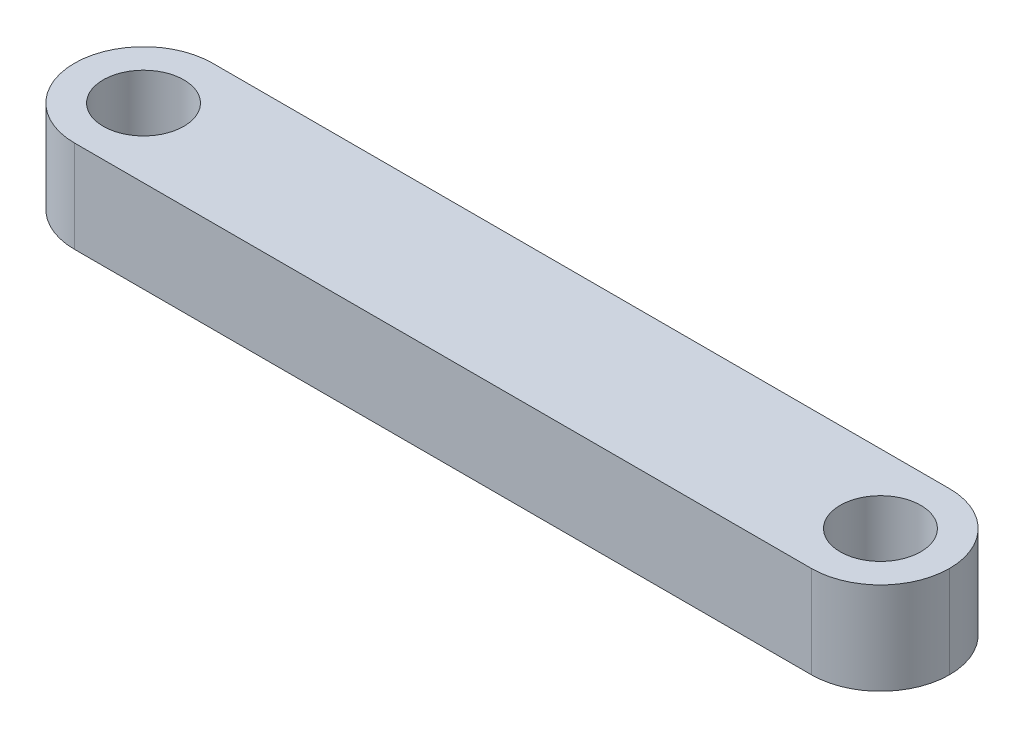
ISO-10303-21;
HEADER;
FILE_DESCRIPTION(('STEP AP214'),'2;1');
FILE_NAME('part.step','',(''),(''),'','','');
FILE_SCHEMA(('AUTOMOTIVE_DESIGN { 1 0 10303 214 1 1 1 1 }'));
ENDSEC;
DATA;
#1=APPLICATION_CONTEXT('core data for automotive mechanical design processes');
#2=APPLICATION_PROTOCOL_DEFINITION('international standard','automotive_design',2000,#1);
#3=PRODUCT_CONTEXT('',#1,'mechanical');
#4=PRODUCT('Part','Part','',(#3));
#5=PRODUCT_RELATED_PRODUCT_CATEGORY('part','',(#4));
#6=PRODUCT_DEFINITION_FORMATION('','',#4);
#7=PRODUCT_DEFINITION_CONTEXT('part definition',#1,'design');
#8=PRODUCT_DEFINITION('design','',#6,#7);
#9=PRODUCT_DEFINITION_SHAPE('','',#8);
#10=(LENGTH_UNIT() NAMED_UNIT(*) SI_UNIT(.MILLI.,.METRE.));
#11=(NAMED_UNIT(*) PLANE_ANGLE_UNIT() SI_UNIT($,.RADIAN.));
#12=(NAMED_UNIT(*) SI_UNIT($,.STERADIAN.) SOLID_ANGLE_UNIT());
#13=UNCERTAINTY_MEASURE_WITH_UNIT(LENGTH_MEASURE(1.E-05),#10,'distance_accuracy_value','');
#14=(GEOMETRIC_REPRESENTATION_CONTEXT(3) GLOBAL_UNCERTAINTY_ASSIGNED_CONTEXT((#13)) GLOBAL_UNIT_ASSIGNED_CONTEXT((#10,
#11,#12)) REPRESENTATION_CONTEXT('',''));
#15=CARTESIAN_POINT('',(0.,0.,0.));
#16=DIRECTION('',(0.,0.,1.));
#17=DIRECTION('',(1.,0.,0.));
#18=AXIS2_PLACEMENT_3D('',#15,#16,#17);
#19=CARTESIAN_POINT('',(0.,4.,0.));
#20=DIRECTION('',(0.,-1.,0.));
#21=DIRECTION('',(0.,0.,-1.));
#22=AXIS2_PLACEMENT_3D('',#19,#20,#21);
#23=PLANE('',#22);
#24=CARTESIAN_POINT('',(35.,4.,-3.));
#25=DIRECTION('',(0.,-1.,0.));
#26=DIRECTION('',(0.,0.,-1.));
#27=AXIS2_PLACEMENT_3D('',#24,#25,#26);
#28=CIRCLE('',#27,3.);
#29=CARTESIAN_POINT('',(35.,4.,0.));
#30=VERTEX_POINT('',#29);
#31=CARTESIAN_POINT('',(38.,4.,-3.));
#32=VERTEX_POINT('',#31);
#33=EDGE_CURVE('E54',#30,#32,#28,.F.);
#34=ORIENTED_EDGE('',*,*,#33,.T.);
#35=CARTESIAN_POINT('',(35.,4.,-3.));
#36=DIRECTION('',(0.,-1.,0.));
#37=DIRECTION('',(0.,0.,-1.));
#38=AXIS2_PLACEMENT_3D('',#35,#36,#37);
#39=CIRCLE('',#38,3.);
#40=CARTESIAN_POINT('',(35.,4.,-6.));
#41=VERTEX_POINT('',#40);
#42=EDGE_CURVE('E136',#32,#41,#39,.F.);
#43=ORIENTED_EDGE('',*,*,#42,.T.);
#44=DIRECTION('',(-1.,0.,0.));
#45=VECTOR('',#44,1.);
#46=CARTESIAN_POINT('',(0.,4.,-6.));
#47=LINE('',#46,#45);
#48=CARTESIAN_POINT('',(3.,4.,-6.));
#49=VERTEX_POINT('',#48);
#50=EDGE_CURVE('E112',#41,#49,#47,.T.);
#51=ORIENTED_EDGE('',*,*,#50,.T.);
#52=CARTESIAN_POINT('',(3.,4.,-3.));
#53=DIRECTION('',(0.,-1.,0.));
#54=DIRECTION('',(0.,0.,-1.));
#55=AXIS2_PLACEMENT_3D('',#52,#53,#54);
#56=CIRCLE('',#55,3.);
#57=CARTESIAN_POINT('',(0.,4.,-3.));
#58=VERTEX_POINT('',#57);
#59=EDGE_CURVE('E133',#49,#58,#56,.F.);
#60=ORIENTED_EDGE('',*,*,#59,.T.);
#61=CARTESIAN_POINT('',(3.,4.,-3.));
#62=DIRECTION('',(0.,-1.,0.));
#63=DIRECTION('',(0.,0.,-1.));
#64=AXIS2_PLACEMENT_3D('',#61,#62,#63);
#65=CIRCLE('',#64,3.);
#66=CARTESIAN_POINT('',(3.,4.,0.));
#67=VERTEX_POINT('',#66);
#68=EDGE_CURVE('E101',#58,#67,#65,.F.);
#69=ORIENTED_EDGE('',*,*,#68,.T.);
#70=DIRECTION('',(1.,0.,0.));
#71=VECTOR('',#70,1.);
#72=CARTESIAN_POINT('',(0.,4.,0.));
#73=LINE('',#72,#71);
#74=EDGE_CURVE('E120',#67,#30,#73,.T.);
#75=ORIENTED_EDGE('',*,*,#74,.T.);
#76=EDGE_LOOP('',(#34,#43,#51,#60,#69,#75));
#77=FACE_BOUND('',#76,.T.);
#78=CARTESIAN_POINT('',(3.,4.,-3.));
#79=DIRECTION('',(0.,1.,0.));
#80=DIRECTION('',(0.,0.,1.));
#81=AXIS2_PLACEMENT_3D('',#78,#79,#80);
#82=CIRCLE('',#81,1.75);
#83=CARTESIAN_POINT('',(3.,4.,-1.25));
#84=VERTEX_POINT('',#83);
#85=EDGE_CURVE('E124',#84,#84,#82,.T.);
#86=ORIENTED_EDGE('',*,*,#85,.F.);
#87=EDGE_LOOP('',(#86));
#88=FACE_BOUND('',#87,.T.);
#89=CARTESIAN_POINT('',(35.,4.,-3.));
#90=DIRECTION('',(0.,1.,0.));
#91=DIRECTION('',(0.,0.,1.));
#92=AXIS2_PLACEMENT_3D('',#89,#90,#91);
#93=CIRCLE('',#92,1.75);
#94=CARTESIAN_POINT('',(35.,4.,-1.25));
#95=VERTEX_POINT('',#94);
#96=EDGE_CURVE('E140',#95,#95,#93,.T.);
#97=ORIENTED_EDGE('',*,*,#96,.F.);
#98=EDGE_LOOP('',(#97));
#99=FACE_BOUND('',#98,.T.);
#100=ADVANCED_FACE('F37',(#77,#88,#99),#23,.F.);
#101=CARTESIAN_POINT('',(0.,0.,0.));
#102=DIRECTION('',(0.,-1.,0.));
#103=DIRECTION('',(0.,0.,-1.));
#104=AXIS2_PLACEMENT_3D('',#101,#102,#103);
#105=PLANE('',#104);
#106=CARTESIAN_POINT('',(3.,0.,-3.));
#107=DIRECTION('',(0.,1.,0.));
#108=DIRECTION('',(0.,0.,1.));
#109=AXIS2_PLACEMENT_3D('',#106,#107,#108);
#110=CIRCLE('',#109,1.75);
#111=CARTESIAN_POINT('',(3.,0.,-1.25));
#112=VERTEX_POINT('',#111);
#113=EDGE_CURVE('E156',#112,#112,#110,.T.);
#114=ORIENTED_EDGE('',*,*,#113,.T.);
#115=EDGE_LOOP('',(#114));
#116=FACE_BOUND('',#115,.T.);
#117=DIRECTION('',(-1.,0.,0.));
#118=VECTOR('',#117,1.);
#119=CARTESIAN_POINT('',(0.,0.,-6.));
#120=LINE('',#119,#118);
#121=CARTESIAN_POINT('',(35.,0.,-6.));
#122=VERTEX_POINT('',#121);
#123=CARTESIAN_POINT('',(3.,0.,-6.));
#124=VERTEX_POINT('',#123);
#125=EDGE_CURVE('E109',#122,#124,#120,.T.);
#126=ORIENTED_EDGE('',*,*,#125,.F.);
#127=CARTESIAN_POINT('',(35.,0.,-3.));
#128=DIRECTION('',(0.,-1.,0.));
#129=DIRECTION('',(0.,0.,-1.));
#130=AXIS2_PLACEMENT_3D('',#127,#128,#129);
#131=CIRCLE('',#130,3.);
#132=CARTESIAN_POINT('',(38.,0.,-3.));
#133=VERTEX_POINT('',#132);
#134=EDGE_CURVE('E92',#122,#133,#131,.T.);
#135=ORIENTED_EDGE('',*,*,#134,.T.);
#136=CARTESIAN_POINT('',(35.,0.,-3.));
#137=DIRECTION('',(0.,-1.,0.));
#138=DIRECTION('',(0.,0.,-1.));
#139=AXIS2_PLACEMENT_3D('',#136,#137,#138);
#140=CIRCLE('',#139,3.);
#141=CARTESIAN_POINT('',(35.,0.,0.));
#142=VERTEX_POINT('',#141);
#143=EDGE_CURVE('E102',#133,#142,#140,.T.);
#144=ORIENTED_EDGE('',*,*,#143,.T.);
#145=DIRECTION('',(1.,0.,0.));
#146=VECTOR('',#145,1.);
#147=CARTESIAN_POINT('',(0.,0.,0.));
#148=LINE('',#147,#146);
#149=CARTESIAN_POINT('',(3.,0.,0.));
#150=VERTEX_POINT('',#149);
#151=EDGE_CURVE('E121',#150,#142,#148,.T.);
#152=ORIENTED_EDGE('',*,*,#151,.F.);
#153=CARTESIAN_POINT('',(3.,0.,-3.));
#154=DIRECTION('',(0.,-1.,0.));
#155=DIRECTION('',(0.,0.,-1.));
#156=AXIS2_PLACEMENT_3D('',#153,#154,#155);
#157=CIRCLE('',#156,3.);
#158=CARTESIAN_POINT('',(0.,0.,-3.));
#159=VERTEX_POINT('',#158);
#160=EDGE_CURVE('E113',#150,#159,#157,.T.);
#161=ORIENTED_EDGE('',*,*,#160,.T.);
#162=CARTESIAN_POINT('',(3.,0.,-3.));
#163=DIRECTION('',(0.,-1.,0.));
#164=DIRECTION('',(0.,0.,-1.));
#165=AXIS2_PLACEMENT_3D('',#162,#163,#164);
#166=CIRCLE('',#165,3.);
#167=EDGE_CURVE('E119',#159,#124,#166,.T.);
#168=ORIENTED_EDGE('',*,*,#167,.T.);
#169=EDGE_LOOP('',(#126,#135,#144,#152,#161,#168));
#170=FACE_BOUND('',#169,.T.);
#171=CARTESIAN_POINT('',(35.,0.,-3.));
#172=DIRECTION('',(0.,1.,0.));
#173=DIRECTION('',(0.,0.,1.));
#174=AXIS2_PLACEMENT_3D('',#171,#172,#173);
#175=CIRCLE('',#174,1.75);
#176=CARTESIAN_POINT('',(35.,0.,-1.25));
#177=VERTEX_POINT('',#176);
#178=EDGE_CURVE('E138',#177,#177,#175,.T.);
#179=ORIENTED_EDGE('',*,*,#178,.T.);
#180=EDGE_LOOP('',(#179));
#181=FACE_BOUND('',#180,.T.);
#182=ADVANCED_FACE('F116',(#116,#170,#181),#105,.T.);
#183=CARTESIAN_POINT('',(0.,4.,0.));
#184=DIRECTION('',(0.,0.,-1.));
#185=DIRECTION('',(-1.,0.,0.));
#186=AXIS2_PLACEMENT_3D('',#183,#184,#185);
#187=PLANE('',#186);
#188=ORIENTED_EDGE('',*,*,#151,.T.);
#189=DIRECTION('',(0.,-1.,0.));
#190=VECTOR('',#189,1.);
#191=CARTESIAN_POINT('',(35.,4.,0.));
#192=LINE('',#191,#190);
#193=EDGE_CURVE('E11',#142,#30,#192,.F.);
#194=ORIENTED_EDGE('',*,*,#193,.T.);
#195=ORIENTED_EDGE('',*,*,#74,.F.);
#196=DIRECTION('',(0.,-1.,0.));
#197=VECTOR('',#196,1.);
#198=CARTESIAN_POINT('',(3.,4.,0.));
#199=LINE('',#198,#197);
#200=EDGE_CURVE('E46',#67,#150,#199,.T.);
#201=ORIENTED_EDGE('',*,*,#200,.T.);
#202=EDGE_LOOP('',(#188,#194,#195,#201));
#203=FACE_BOUND('',#202,.T.);
#204=ADVANCED_FACE('F151',(#203),#187,.F.);
#205=CARTESIAN_POINT('',(0.,4.,-6.));
#206=DIRECTION('',(0.,0.,1.));
#207=DIRECTION('',(1.,0.,0.));
#208=AXIS2_PLACEMENT_3D('',#205,#206,#207);
#209=PLANE('',#208);
#210=ORIENTED_EDGE('',*,*,#50,.F.);
#211=DIRECTION('',(0.,-1.,0.));
#212=VECTOR('',#211,1.);
#213=CARTESIAN_POINT('',(35.,4.,-6.));
#214=LINE('',#213,#212);
#215=EDGE_CURVE('E96',#41,#122,#214,.T.);
#216=ORIENTED_EDGE('',*,*,#215,.T.);
#217=ORIENTED_EDGE('',*,*,#125,.T.);
#218=DIRECTION('',(0.,-1.,0.));
#219=VECTOR('',#218,1.);
#220=CARTESIAN_POINT('',(3.,4.,-6.));
#221=LINE('',#220,#219);
#222=EDGE_CURVE('E114',#124,#49,#221,.F.);
#223=ORIENTED_EDGE('',*,*,#222,.T.);
#224=EDGE_LOOP('',(#210,#216,#217,#223));
#225=FACE_BOUND('',#224,.T.);
#226=ADVANCED_FACE('F107',(#225),#209,.F.);
#227=CARTESIAN_POINT('',(3.,4.,-3.));
#228=DIRECTION('',(0.,-1.,0.));
#229=DIRECTION('',(0.,0.,-1.));
#230=AXIS2_PLACEMENT_3D('',#227,#228,#229);
#231=CYLINDRICAL_SURFACE('',#230,1.75);
#232=ORIENTED_EDGE('',*,*,#85,.T.);
#233=EDGE_LOOP('',(#232));
#234=FACE_BOUND('',#233,.T.);
#235=ORIENTED_EDGE('',*,*,#113,.F.);
#236=EDGE_LOOP('',(#235));
#237=FACE_BOUND('',#236,.T.);
#238=ADVANCED_FACE('F175',(#234,#237),#231,.F.);
#239=CARTESIAN_POINT('',(35.,4.,-3.));
#240=DIRECTION('',(0.,-1.,0.));
#241=DIRECTION('',(0.,0.,-1.));
#242=AXIS2_PLACEMENT_3D('',#239,#240,#241);
#243=CYLINDRICAL_SURFACE('',#242,1.75);
#244=ORIENTED_EDGE('',*,*,#96,.T.);
#245=EDGE_LOOP('',(#244));
#246=FACE_BOUND('',#245,.T.);
#247=ORIENTED_EDGE('',*,*,#178,.F.);
#248=EDGE_LOOP('',(#247));
#249=FACE_BOUND('',#248,.T.);
#250=ADVANCED_FACE('F164',(#246,#249),#243,.F.);
#251=CARTESIAN_POINT('',(35.,4.,-3.));
#252=DIRECTION('',(0.,-1.,0.));
#253=DIRECTION('',(0.,0.,-1.));
#254=AXIS2_PLACEMENT_3D('',#251,#252,#253);
#255=CYLINDRICAL_SURFACE('',#254,3.);
#256=DIRECTION('',(0.,-1.,0.));
#257=VECTOR('',#256,1.);
#258=CARTESIAN_POINT('',(38.,4.,-3.));
#259=LINE('',#258,#257);
#260=EDGE_CURVE('E97',#32,#133,#259,.T.);
#261=ORIENTED_EDGE('',*,*,#260,.F.);
#262=ORIENTED_EDGE('',*,*,#33,.F.);
#263=ORIENTED_EDGE('',*,*,#193,.F.);
#264=ORIENTED_EDGE('',*,*,#143,.F.);
#265=EDGE_LOOP('',(#261,#262,#263,#264));
#266=FACE_BOUND('',#265,.T.);
#267=ADVANCED_FACE('F154',(#266),#255,.T.);
#268=CARTESIAN_POINT('',(35.,4.,-3.));
#269=DIRECTION('',(0.,-1.,0.));
#270=DIRECTION('',(0.,0.,-1.));
#271=AXIS2_PLACEMENT_3D('',#268,#269,#270);
#272=CYLINDRICAL_SURFACE('',#271,3.);
#273=ORIENTED_EDGE('',*,*,#42,.F.);
#274=ORIENTED_EDGE('',*,*,#260,.T.);
#275=ORIENTED_EDGE('',*,*,#134,.F.);
#276=ORIENTED_EDGE('',*,*,#215,.F.);
#277=EDGE_LOOP('',(#273,#274,#275,#276));
#278=FACE_BOUND('',#277,.T.);
#279=ADVANCED_FACE('F95',(#278),#272,.T.);
#280=CARTESIAN_POINT('',(3.,4.,-3.));
#281=DIRECTION('',(0.,-1.,0.));
#282=DIRECTION('',(0.,0.,-1.));
#283=AXIS2_PLACEMENT_3D('',#280,#281,#282);
#284=CYLINDRICAL_SURFACE('',#283,3.);
#285=ORIENTED_EDGE('',*,*,#200,.F.);
#286=ORIENTED_EDGE('',*,*,#68,.F.);
#287=DIRECTION('',(0.,-1.,0.));
#288=VECTOR('',#287,1.);
#289=CARTESIAN_POINT('',(0.,4.,-3.));
#290=LINE('',#289,#288);
#291=EDGE_CURVE('E41',#159,#58,#290,.F.);
#292=ORIENTED_EDGE('',*,*,#291,.F.);
#293=ORIENTED_EDGE('',*,*,#160,.F.);
#294=EDGE_LOOP('',(#285,#286,#292,#293));
#295=FACE_BOUND('',#294,.T.);
#296=ADVANCED_FACE('F39',(#295),#284,.T.);
#297=CARTESIAN_POINT('',(3.,4.,-3.));
#298=DIRECTION('',(0.,-1.,0.));
#299=DIRECTION('',(0.,0.,-1.));
#300=AXIS2_PLACEMENT_3D('',#297,#298,#299);
#301=CYLINDRICAL_SURFACE('',#300,3.);
#302=ORIENTED_EDGE('',*,*,#59,.F.);
#303=ORIENTED_EDGE('',*,*,#222,.F.);
#304=ORIENTED_EDGE('',*,*,#167,.F.);
#305=ORIENTED_EDGE('',*,*,#291,.T.);
#306=EDGE_LOOP('',(#302,#303,#304,#305));
#307=FACE_BOUND('',#306,.T.);
#308=ADVANCED_FACE('F145',(#307),#301,.T.);
#309=CLOSED_SHELL('',(#100,#182,#204,#226,#238,#250,#267,#279,#296,#308));
#310=MANIFOLD_SOLID_BREP('B2',#309);
#311=ADVANCED_BREP_SHAPE_REPRESENTATION('',(#18,#310),#14);
#312=SHAPE_DEFINITION_REPRESENTATION(#9,#311);
ENDSEC;
END-ISO-10303-21;
